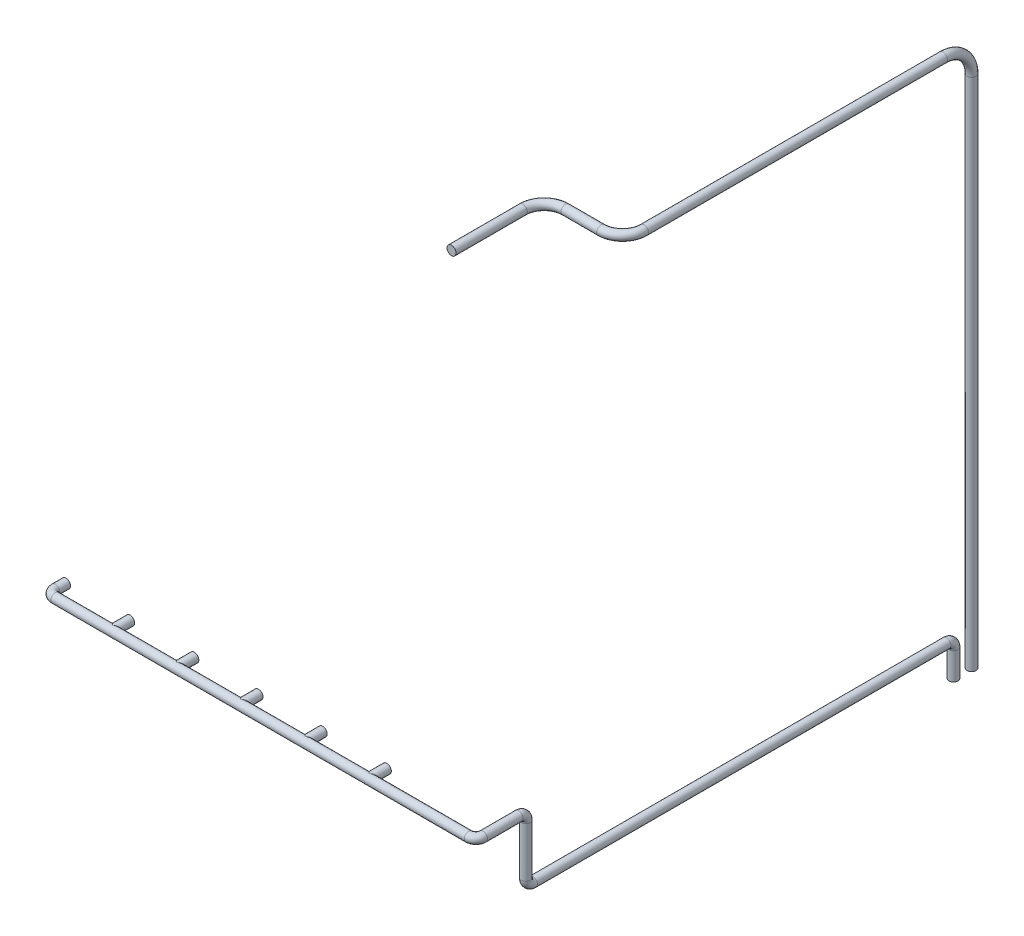
ISO-10303-21;
HEADER;
FILE_DESCRIPTION(('STEP AP214'),'2;1');
FILE_NAME('part.step','',(''),(''),'','','');
FILE_SCHEMA(('AUTOMOTIVE_DESIGN { 1 0 10303 214 1 1 1 1 }'));
ENDSEC;
DATA;
#1=APPLICATION_CONTEXT('core data for automotive mechanical design processes');
#2=APPLICATION_PROTOCOL_DEFINITION('international standard','automotive_design',2000,#1);
#3=PRODUCT_CONTEXT('',#1,'mechanical');
#4=PRODUCT('Part','Part','',(#3));
#5=PRODUCT_RELATED_PRODUCT_CATEGORY('part','',(#4));
#6=PRODUCT_DEFINITION_FORMATION('','',#4);
#7=PRODUCT_DEFINITION_CONTEXT('part definition',#1,'design');
#8=PRODUCT_DEFINITION('design','',#6,#7);
#9=PRODUCT_DEFINITION_SHAPE('','',#8);
#10=(LENGTH_UNIT() NAMED_UNIT(*) SI_UNIT(.MILLI.,.METRE.));
#11=(NAMED_UNIT(*) PLANE_ANGLE_UNIT() SI_UNIT($,.RADIAN.));
#12=(NAMED_UNIT(*) SI_UNIT($,.STERADIAN.) SOLID_ANGLE_UNIT());
#13=UNCERTAINTY_MEASURE_WITH_UNIT(LENGTH_MEASURE(1.E-05),#10,'distance_accuracy_value','');
#14=(GEOMETRIC_REPRESENTATION_CONTEXT(3) GLOBAL_UNCERTAINTY_ASSIGNED_CONTEXT((#13)) GLOBAL_UNIT_ASSIGNED_CONTEXT((#10,
#11,#12)) REPRESENTATION_CONTEXT('',''));
#15=CARTESIAN_POINT('',(0.,0.,0.));
#16=DIRECTION('',(0.,0.,1.));
#17=DIRECTION('',(1.,0.,0.));
#18=AXIS2_PLACEMENT_3D('',#15,#16,#17);
#19=CARTESIAN_POINT('',(6063.5,-1280.,-6704.));
#20=DIRECTION('',(0.,-1.,0.));
#21=DIRECTION('',(0.,0.,-1.));
#22=AXIS2_PLACEMENT_3D('',#19,#20,#21);
#23=CYLINDRICAL_SURFACE('',#22,63.5000000000008);
#24=CARTESIAN_POINT('',(6063.5,-1380.,-6704.));
#25=DIRECTION('',(0.,-1.,0.));
#26=DIRECTION('',(0.,0.,-1.));
#27=AXIS2_PLACEMENT_3D('',#24,#25,#26);
#28=CIRCLE('',#27,63.5000000000008);
#29=CARTESIAN_POINT('',(6063.5,-1380.,-6767.5));
#30=VERTEX_POINT('',#29);
#31=EDGE_CURVE('E12',#30,#30,#28,.T.);
#32=ORIENTED_EDGE('',*,*,#31,.F.);
#33=EDGE_LOOP('',(#32));
#34=FACE_BOUND('',#33,.T.);
#35=CARTESIAN_POINT('',(6063.5,5840.,-6704.));
#36=DIRECTION('',(0.,1.,0.));
#37=DIRECTION('',(0.,0.,1.));
#38=AXIS2_PLACEMENT_3D('',#35,#36,#37);
#39=CIRCLE('',#38,63.5000000000008);
#40=CARTESIAN_POINT('',(6063.5,5840.,-6767.5));
#41=VERTEX_POINT('',#40);
#42=EDGE_CURVE('E73',#41,#41,#39,.T.);
#43=ORIENTED_EDGE('',*,*,#42,.F.);
#44=EDGE_LOOP('',(#43));
#45=FACE_BOUND('',#44,.T.);
#46=ADVANCED_FACE('F45',(#34,#45),#23,.T.);
#47=CARTESIAN_POINT('',(6063.5,-1380.,-6704.));
#48=DIRECTION('',(0.,-1.,0.));
#49=DIRECTION('',(0.,0.,-1.));
#50=AXIS2_PLACEMENT_3D('',#47,#48,#49);
#51=PLANE('',#50);
#52=ORIENTED_EDGE('',*,*,#31,.T.);
#53=EDGE_LOOP('',(#52));
#54=FACE_BOUND('',#53,.T.);
#55=ADVANCED_FACE('F80',(#54),#51,.T.);
#56=CARTESIAN_POINT('',(4963.5,6240.,-507.720850112618));
#57=DIRECTION('',(0.,0.,1.));
#58=DIRECTION('',(0.,-1.,0.));
#59=AXIS2_PLACEMENT_3D('',#56,#57,#58);
#60=PLANE('',#59);
#61=CARTESIAN_POINT('',(4963.5,6240.,-507.720850112618));
#62=DIRECTION('',(0.,0.,1.));
#63=DIRECTION('',(0.,-1.,0.));
#64=AXIS2_PLACEMENT_3D('',#61,#62,#63);
#65=CIRCLE('',#64,63.5000000000008);
#66=CARTESIAN_POINT('',(4963.5,6176.5,-507.720850112618));
#67=VERTEX_POINT('',#66);
#68=EDGE_CURVE('E51',#67,#67,#65,.T.);
#69=ORIENTED_EDGE('',*,*,#68,.T.);
#70=EDGE_LOOP('',(#69));
#71=FACE_BOUND('',#70,.T.);
#72=ADVANCED_FACE('F55',(#71),#60,.T.);
#73=CARTESIAN_POINT('',(6063.5,5840.,-6304.));
#74=DIRECTION('',(1.,0.,0.));
#75=DIRECTION('',(0.,0.,-1.));
#76=AXIS2_PLACEMENT_3D('',#73,#74,#75);
#77=TOROIDAL_SURFACE('',#76,400.,63.5000000000008);
#78=CARTESIAN_POINT('',(6063.5,6240.,-6304.));
#79=DIRECTION('',(0.,0.,1.));
#80=DIRECTION('',(0.,-1.,0.));
#81=AXIS2_PLACEMENT_3D('',#78,#79,#80);
#82=CIRCLE('',#81,63.5000000000008);
#83=CARTESIAN_POINT('',(6063.5,6303.5,-6304.));
#84=VERTEX_POINT('',#83);
#85=EDGE_CURVE('E70',#84,#84,#82,.T.);
#86=CARTESIAN_POINT('',(6063.5,5840.,-6304.));
#87=DIRECTION('',(1.,0.,0.));
#88=DIRECTION('',(0.,0.,-1.));
#89=AXIS2_PLACEMENT_3D('',#86,#87,#88);
#90=CIRCLE('',#89,463.500000000001);
#91=EDGE_CURVE('',#41,#84,#90,.T.);
#92=ORIENTED_EDGE('',*,*,#42,.T.);
#93=ORIENTED_EDGE('',*,*,#85,.F.);
#94=ORIENTED_EDGE('',*,*,#91,.T.);
#95=ORIENTED_EDGE('',*,*,#91,.F.);
#96=EDGE_LOOP('',(#92,#94,#93,#95));
#97=FACE_BOUND('',#96,.T.);
#98=ADVANCED_FACE('F77',(#97),#77,.T.);
#99=CARTESIAN_POINT('',(6063.5,6240.,-6304.));
#100=DIRECTION('',(0.,0.,1.));
#101=DIRECTION('',(1.,0.,0.));
#102=AXIS2_PLACEMENT_3D('',#99,#100,#101);
#103=CYLINDRICAL_SURFACE('',#102,63.5000000000008);
#104=CARTESIAN_POINT('',(6063.5,6240.,-2107.72085011262));
#105=DIRECTION('',(0.,0.,1.));
#106=DIRECTION('',(0.,-1.,0.));
#107=AXIS2_PLACEMENT_3D('',#104,#105,#106);
#108=CIRCLE('',#107,63.5000000000008);
#109=CARTESIAN_POINT('',(6127.,6240.,-2107.72085011262));
#110=VERTEX_POINT('',#109);
#111=EDGE_CURVE('E67',#110,#110,#108,.T.);
#112=ORIENTED_EDGE('',*,*,#111,.F.);
#113=EDGE_LOOP('',(#112));
#114=FACE_BOUND('',#113,.T.);
#115=ORIENTED_EDGE('',*,*,#85,.T.);
#116=EDGE_LOOP('',(#115));
#117=FACE_BOUND('',#116,.T.);
#118=ADVANCED_FACE('F109',(#114,#117),#103,.T.);
#119=CARTESIAN_POINT('',(5763.5,6240.,-2107.72085011262));
#120=DIRECTION('',(0.,-1.,0.));
#121=DIRECTION('',(0.,0.,-1.));
#122=AXIS2_PLACEMENT_3D('',#119,#120,#121);
#123=TOROIDAL_SURFACE('',#122,300.,63.5000000000008);
#124=CARTESIAN_POINT('',(5763.5,6240.,-1807.72085011262));
#125=DIRECTION('',(-1.,0.,0.));
#126=DIRECTION('',(0.,-1.,0.));
#127=AXIS2_PLACEMENT_3D('',#124,#125,#126);
#128=CIRCLE('',#127,63.5000000000008);
#129=CARTESIAN_POINT('',(5763.5,6240.,-1744.22085011262));
#130=VERTEX_POINT('',#129);
#131=EDGE_CURVE('E64',#130,#130,#128,.T.);
#132=CARTESIAN_POINT('',(5763.5,6240.,-2107.72085011262));
#133=DIRECTION('',(0.,-1.,0.));
#134=DIRECTION('',(0.,0.,-1.));
#135=AXIS2_PLACEMENT_3D('',#132,#133,#134);
#136=CIRCLE('',#135,363.500000000001);
#137=EDGE_CURVE('',#110,#130,#136,.T.);
#138=ORIENTED_EDGE('',*,*,#111,.T.);
#139=ORIENTED_EDGE('',*,*,#131,.F.);
#140=ORIENTED_EDGE('',*,*,#137,.T.);
#141=ORIENTED_EDGE('',*,*,#137,.F.);
#142=EDGE_LOOP('',(#138,#140,#139,#141));
#143=FACE_BOUND('',#142,.T.);
#144=ADVANCED_FACE('F105',(#143),#123,.T.);
#145=CARTESIAN_POINT('',(5763.5,6240.,-1807.72085011262));
#146=DIRECTION('',(-1.,0.,0.));
#147=DIRECTION('',(0.,0.,1.));
#148=AXIS2_PLACEMENT_3D('',#145,#146,#147);
#149=CYLINDRICAL_SURFACE('',#148,63.5000000000008);
#150=CARTESIAN_POINT('',(5263.5,6240.,-1807.72085011262));
#151=DIRECTION('',(-1.,0.,0.));
#152=DIRECTION('',(0.,-1.,0.));
#153=AXIS2_PLACEMENT_3D('',#150,#151,#152);
#154=CIRCLE('',#153,63.5000000000008);
#155=CARTESIAN_POINT('',(5263.5,6240.,-1871.22085011262));
#156=VERTEX_POINT('',#155);
#157=EDGE_CURVE('E59',#156,#156,#154,.T.);
#158=ORIENTED_EDGE('',*,*,#157,.F.);
#159=EDGE_LOOP('',(#158));
#160=FACE_BOUND('',#159,.T.);
#161=ORIENTED_EDGE('',*,*,#131,.T.);
#162=EDGE_LOOP('',(#161));
#163=FACE_BOUND('',#162,.T.);
#164=ADVANCED_FACE('F98',(#160,#163),#149,.T.);
#165=CARTESIAN_POINT('',(5263.5,6240.,-1507.72085011262));
#166=DIRECTION('',(0.,1.,0.));
#167=DIRECTION('',(0.,0.,1.));
#168=AXIS2_PLACEMENT_3D('',#165,#166,#167);
#169=TOROIDAL_SURFACE('',#168,300.,63.5000000000008);
#170=CARTESIAN_POINT('',(4963.5,6240.,-1507.72085011262));
#171=DIRECTION('',(0.,0.,1.));
#172=DIRECTION('',(0.,-1.,0.));
#173=AXIS2_PLACEMENT_3D('',#170,#171,#172);
#174=CIRCLE('',#173,63.5000000000008);
#175=CARTESIAN_POINT('',(4900.,6240.,-1507.72085011262));
#176=VERTEX_POINT('',#175);
#177=EDGE_CURVE('E57',#176,#176,#174,.T.);
#178=CARTESIAN_POINT('',(5263.5,6240.,-1507.72085011262));
#179=DIRECTION('',(0.,1.,0.));
#180=DIRECTION('',(0.,0.,1.));
#181=AXIS2_PLACEMENT_3D('',#178,#179,#180);
#182=CIRCLE('',#181,363.500000000001);
#183=EDGE_CURVE('',#156,#176,#182,.T.);
#184=ORIENTED_EDGE('',*,*,#157,.T.);
#185=ORIENTED_EDGE('',*,*,#177,.F.);
#186=ORIENTED_EDGE('',*,*,#183,.T.);
#187=ORIENTED_EDGE('',*,*,#183,.F.);
#188=EDGE_LOOP('',(#184,#186,#185,#187));
#189=FACE_BOUND('',#188,.T.);
#190=ADVANCED_FACE('F93',(#189),#169,.T.);
#191=CARTESIAN_POINT('',(4963.5,6240.,-1507.72085011262));
#192=DIRECTION('',(0.,0.,1.));
#193=DIRECTION('',(1.,0.,0.));
#194=AXIS2_PLACEMENT_3D('',#191,#192,#193);
#195=CYLINDRICAL_SURFACE('',#194,63.5000000000008);
#196=ORIENTED_EDGE('',*,*,#68,.F.);
#197=EDGE_LOOP('',(#196));
#198=FACE_BOUND('',#197,.T.);
#199=ORIENTED_EDGE('',*,*,#177,.T.);
#200=EDGE_LOOP('',(#199));
#201=FACE_BOUND('',#200,.T.);
#202=ADVANCED_FACE('F86',(#198,#201),#195,.T.);
#203=CLOSED_SHELL('',(#46,#55,#72,#98,#118,#144,#164,#190,#202));
#204=MANIFOLD_SOLID_BREP('B2',#203);
#205=CARTESIAN_POINT('',(4563.5,0.,50.));
#206=DIRECTION('',(0.,0.,-1.));
#207=DIRECTION('',(-1.,0.,0.));
#208=AXIS2_PLACEMENT_3D('',#205,#206,#207);
#209=CYLINDRICAL_SURFACE('',#208,63.5000000000007);
#210=CARTESIAN_POINT('',(4563.5,0.,0.));
#211=DIRECTION('',(0.,0.,1.));
#212=DIRECTION('',(1.,0.,0.));
#213=AXIS2_PLACEMENT_3D('',#210,#211,#212);
#214=CIRCLE('',#213,63.5000000000007);
#215=CARTESIAN_POINT('',(4627.,0.,0.));
#216=VERTEX_POINT('',#215);
#217=EDGE_CURVE('E43',#216,#216,#214,.T.);
#218=ORIENTED_EDGE('',*,*,#217,.T.);
#219=EDGE_LOOP('',(#218));
#220=FACE_BOUND('',#219,.T.);
#221=CARTESIAN_POINT('',(4563.5,0.,250.));
#222=DIRECTION('',(-0.707106781186547,0.,-0.707106781186547));
#223=DIRECTION('',(0.707106781186547,0.,-0.707106781186547));
#224=AXIS2_PLACEMENT_3D('',#221,#222,#223);
#225=ELLIPSE('',#224,89.8025612106921,63.5000000000004);
#226=CARTESIAN_POINT('',(4563.5,63.5000000000004,250.));
#227=VERTEX_POINT('',#226);
#228=CARTESIAN_POINT('',(4563.5,-63.5000000000004,250.));
#229=VERTEX_POINT('',#228);
#230=EDGE_CURVE('E207',#227,#229,#225,.T.);
#231=ORIENTED_EDGE('',*,*,#230,.T.);
#232=CARTESIAN_POINT('',(4563.5,0.,250.));
#233=DIRECTION('',(0.707106781186547,0.,-0.707106781186547));
#234=DIRECTION('',(-0.707106781186547,0.,-0.707106781186547));
#235=AXIS2_PLACEMENT_3D('',#232,#233,#234);
#236=ELLIPSE('',#235,89.8025612106921,63.5000000000004);
#237=EDGE_CURVE('E199',#229,#227,#236,.T.);
#238=ORIENTED_EDGE('',*,*,#237,.T.);
#239=EDGE_LOOP('',(#231,#238));
#240=FACE_BOUND('',#239,.T.);
#241=ADVANCED_FACE('F192',(#220,#240),#209,.T.);
#242=CARTESIAN_POINT('',(4563.5,0.,0.));
#243=DIRECTION('',(0.,0.,1.));
#244=DIRECTION('',(1.,0.,0.));
#245=AXIS2_PLACEMENT_3D('',#242,#243,#244);
#246=PLANE('',#245);
#247=ORIENTED_EDGE('',*,*,#217,.F.);
#248=EDGE_LOOP('',(#247));
#249=FACE_BOUND('',#248,.T.);
#250=ADVANCED_FACE('F287',(#249),#246,.F.);
#251=CARTESIAN_POINT('',(163.5,0.,250.));
#252=DIRECTION('',(1.,0.,0.));
#253=DIRECTION('',(0.,0.,-1.));
#254=AXIS2_PLACEMENT_3D('',#251,#252,#253);
#255=CYLINDRICAL_SURFACE('',#254,63.5);
#256=CARTESIAN_POINT('',(3663.5,0.,250.));
#257=DIRECTION('',(0.707106781186547,0.,-0.707106781186547));
#258=DIRECTION('',(-0.707106781186547,0.,-0.707106781186547));
#259=AXIS2_PLACEMENT_3D('',#256,#257,#258);
#260=ELLIPSE('',#259,89.8025612106914,63.4999999999999);
#261=CARTESIAN_POINT('',(3663.5,-63.4999999999999,250.));
#262=VERTEX_POINT('',#261);
#263=CARTESIAN_POINT('',(3663.5,63.4999999999999,250.));
#264=VERTEX_POINT('',#263);
#265=EDGE_CURVE('E277',#262,#264,#260,.T.);
#266=ORIENTED_EDGE('',*,*,#265,.F.);
#267=CARTESIAN_POINT('',(3663.5,0.,250.));
#268=DIRECTION('',(-0.707106781186547,0.,-0.707106781186547));
#269=DIRECTION('',(0.707106781186547,0.,-0.707106781186547));
#270=AXIS2_PLACEMENT_3D('',#267,#268,#269);
#271=ELLIPSE('',#270,89.8025612106914,63.4999999999999);
#272=EDGE_CURVE('E276',#264,#262,#271,.T.);
#273=ORIENTED_EDGE('',*,*,#272,.F.);
#274=EDGE_LOOP('',(#266,#273));
#275=FACE_BOUND('',#274,.T.);
#276=CARTESIAN_POINT('',(1863.5,0.,250.));
#277=DIRECTION('',(0.707106781186547,0.,-0.707106781186547));
#278=DIRECTION('',(-0.707106781186547,0.,-0.707106781186547));
#279=AXIS2_PLACEMENT_3D('',#276,#277,#278);
#280=ELLIPSE('',#279,89.8025612106916,63.5);
#281=CARTESIAN_POINT('',(1863.5,-63.5,250.));
#282=VERTEX_POINT('',#281);
#283=CARTESIAN_POINT('',(1863.5,63.4999999999999,250.));
#284=VERTEX_POINT('',#283);
#285=EDGE_CURVE('E259',#282,#284,#280,.T.);
#286=ORIENTED_EDGE('',*,*,#285,.F.);
#287=CARTESIAN_POINT('',(1863.5,0.,250.));
#288=DIRECTION('',(-0.707106781186547,0.,-0.707106781186547));
#289=DIRECTION('',(0.707106781186547,0.,-0.707106781186547));
#290=AXIS2_PLACEMENT_3D('',#287,#288,#289);
#291=ELLIPSE('',#290,89.8025612106916,63.5);
#292=EDGE_CURVE('E258',#284,#282,#291,.T.);
#293=ORIENTED_EDGE('',*,*,#292,.F.);
#294=EDGE_LOOP('',(#286,#293));
#295=FACE_BOUND('',#294,.T.);
#296=CARTESIAN_POINT('',(163.5,0.,250.));
#297=DIRECTION('',(1.,0.,0.));
#298=DIRECTION('',(0.,0.,-1.));
#299=AXIS2_PLACEMENT_3D('',#296,#297,#298);
#300=CIRCLE('',#299,63.5);
#301=CARTESIAN_POINT('',(163.5,0.,313.5));
#302=VERTEX_POINT('',#301);
#303=EDGE_CURVE('E382',#302,#302,#300,.T.);
#304=ORIENTED_EDGE('',*,*,#303,.T.);
#305=EDGE_LOOP('',(#304));
#306=FACE_BOUND('',#305,.T.);
#307=CARTESIAN_POINT('',(5963.5,0.,250.));
#308=DIRECTION('',(1.,0.,0.));
#309=DIRECTION('',(0.,0.,-1.));
#310=AXIS2_PLACEMENT_3D('',#307,#308,#309);
#311=CIRCLE('',#310,63.5);
#312=CARTESIAN_POINT('',(5963.5,0.,313.5));
#313=VERTEX_POINT('',#312);
#314=EDGE_CURVE('E388',#313,#313,#311,.T.);
#315=ORIENTED_EDGE('',*,*,#314,.F.);
#316=EDGE_LOOP('',(#315));
#317=FACE_BOUND('',#316,.T.);
#318=CARTESIAN_POINT('',(963.5,0.,250.));
#319=DIRECTION('',(0.707106781186547,0.,-0.707106781186547));
#320=DIRECTION('',(-0.707106781186547,0.,-0.707106781186547));
#321=AXIS2_PLACEMENT_3D('',#318,#319,#320);
#322=ELLIPSE('',#321,89.8025612106916,63.5);
#323=CARTESIAN_POINT('',(963.5,-63.5,250.));
#324=VERTEX_POINT('',#323);
#325=CARTESIAN_POINT('',(963.5,63.5,250.));
#326=VERTEX_POINT('',#325);
#327=EDGE_CURVE('E250',#324,#326,#322,.T.);
#328=ORIENTED_EDGE('',*,*,#327,.F.);
#329=CARTESIAN_POINT('',(963.5,0.,250.));
#330=DIRECTION('',(-0.707106781186547,0.,-0.707106781186547));
#331=DIRECTION('',(0.707106781186547,0.,-0.707106781186547));
#332=AXIS2_PLACEMENT_3D('',#329,#330,#331);
#333=ELLIPSE('',#332,89.8025612106916,63.5);
#334=EDGE_CURVE('E243',#326,#324,#333,.T.);
#335=ORIENTED_EDGE('',*,*,#334,.F.);
#336=EDGE_LOOP('',(#328,#335));
#337=FACE_BOUND('',#336,.T.);
#338=CARTESIAN_POINT('',(2763.5,0.,250.));
#339=DIRECTION('',(0.707106781186547,0.,-0.707106781186547));
#340=DIRECTION('',(-0.707106781186547,0.,-0.707106781186547));
#341=AXIS2_PLACEMENT_3D('',#338,#339,#340);
#342=ELLIPSE('',#341,89.8025612106914,63.4999999999999);
#343=CARTESIAN_POINT('',(2763.5,-63.4999999999999,250.));
#344=VERTEX_POINT('',#343);
#345=CARTESIAN_POINT('',(2763.5,63.4999999999999,250.));
#346=VERTEX_POINT('',#345);
#347=EDGE_CURVE('E268',#344,#346,#342,.T.);
#348=ORIENTED_EDGE('',*,*,#347,.F.);
#349=CARTESIAN_POINT('',(2763.5,0.,250.));
#350=DIRECTION('',(-0.707106781186547,0.,-0.707106781186547));
#351=DIRECTION('',(0.707106781186547,0.,-0.707106781186547));
#352=AXIS2_PLACEMENT_3D('',#349,#350,#351);
#353=ELLIPSE('',#352,89.8025612106914,63.4999999999999);
#354=EDGE_CURVE('E267',#346,#344,#353,.T.);
#355=ORIENTED_EDGE('',*,*,#354,.F.);
#356=EDGE_LOOP('',(#348,#355));
#357=FACE_BOUND('',#356,.T.);
#358=ORIENTED_EDGE('',*,*,#237,.F.);
#359=ORIENTED_EDGE('',*,*,#230,.F.);
#360=EDGE_LOOP('',(#358,#359));
#361=FACE_BOUND('',#360,.T.);
#362=ADVANCED_FACE('F292',(#275,#295,#306,#317,#337,#357,#361),#255,.T.);
#363=CARTESIAN_POINT('',(3663.5,0.,50.));
#364=DIRECTION('',(0.,0.,-1.));
#365=DIRECTION('',(-1.,0.,0.));
#366=AXIS2_PLACEMENT_3D('',#363,#364,#365);
#367=CYLINDRICAL_SURFACE('',#366,63.4999999999999);
#368=CARTESIAN_POINT('',(3663.5,0.,0.));
#369=DIRECTION('',(0.,0.,1.));
#370=DIRECTION('',(1.,0.,0.));
#371=AXIS2_PLACEMENT_3D('',#368,#369,#370);
#372=CIRCLE('',#371,63.4999999999999);
#373=CARTESIAN_POINT('',(3727.,0.,0.));
#374=VERTEX_POINT('',#373);
#375=EDGE_CURVE('E280',#374,#374,#372,.T.);
#376=ORIENTED_EDGE('',*,*,#375,.T.);
#377=EDGE_LOOP('',(#376));
#378=FACE_BOUND('',#377,.T.);
#379=ORIENTED_EDGE('',*,*,#272,.T.);
#380=ORIENTED_EDGE('',*,*,#265,.T.);
#381=EDGE_LOOP('',(#379,#380));
#382=FACE_BOUND('',#381,.T.);
#383=ADVANCED_FACE('F298',(#378,#382),#367,.T.);
#384=CARTESIAN_POINT('',(3663.5,0.,0.));
#385=DIRECTION('',(0.,0.,1.));
#386=DIRECTION('',(1.,0.,0.));
#387=AXIS2_PLACEMENT_3D('',#384,#385,#386);
#388=PLANE('',#387);
#389=ORIENTED_EDGE('',*,*,#375,.F.);
#390=EDGE_LOOP('',(#389));
#391=FACE_BOUND('',#390,.T.);
#392=ADVANCED_FACE('F304',(#391),#388,.F.);
#393=CARTESIAN_POINT('',(2763.5,0.,50.));
#394=DIRECTION('',(0.,0.,-1.));
#395=DIRECTION('',(-1.,0.,0.));
#396=AXIS2_PLACEMENT_3D('',#393,#394,#395);
#397=CYLINDRICAL_SURFACE('',#396,63.4999999999999);
#398=CARTESIAN_POINT('',(2763.5,0.,0.));
#399=DIRECTION('',(0.,0.,1.));
#400=DIRECTION('',(1.,0.,0.));
#401=AXIS2_PLACEMENT_3D('',#398,#399,#400);
#402=CIRCLE('',#401,63.4999999999999);
#403=CARTESIAN_POINT('',(2827.,0.,0.));
#404=VERTEX_POINT('',#403);
#405=EDGE_CURVE('E271',#404,#404,#402,.T.);
#406=ORIENTED_EDGE('',*,*,#405,.T.);
#407=EDGE_LOOP('',(#406));
#408=FACE_BOUND('',#407,.T.);
#409=ORIENTED_EDGE('',*,*,#354,.T.);
#410=ORIENTED_EDGE('',*,*,#347,.T.);
#411=EDGE_LOOP('',(#409,#410));
#412=FACE_BOUND('',#411,.T.);
#413=ADVANCED_FACE('F308',(#408,#412),#397,.T.);
#414=CARTESIAN_POINT('',(2763.5,0.,0.));
#415=DIRECTION('',(0.,0.,1.));
#416=DIRECTION('',(1.,0.,0.));
#417=AXIS2_PLACEMENT_3D('',#414,#415,#416);
#418=PLANE('',#417);
#419=ORIENTED_EDGE('',*,*,#405,.F.);
#420=EDGE_LOOP('',(#419));
#421=FACE_BOUND('',#420,.T.);
#422=ADVANCED_FACE('F312',(#421),#418,.F.);
#423=CARTESIAN_POINT('',(1863.5,0.,50.));
#424=DIRECTION('',(0.,0.,-1.));
#425=DIRECTION('',(-1.,0.,0.));
#426=AXIS2_PLACEMENT_3D('',#423,#424,#425);
#427=CYLINDRICAL_SURFACE('',#426,63.4999999999999);
#428=CARTESIAN_POINT('',(1863.5,0.,0.));
#429=DIRECTION('',(0.,0.,1.));
#430=DIRECTION('',(1.,0.,0.));
#431=AXIS2_PLACEMENT_3D('',#428,#429,#430);
#432=CIRCLE('',#431,63.4999999999999);
#433=CARTESIAN_POINT('',(1927.,0.,0.));
#434=VERTEX_POINT('',#433);
#435=EDGE_CURVE('E262',#434,#434,#432,.T.);
#436=ORIENTED_EDGE('',*,*,#435,.T.);
#437=EDGE_LOOP('',(#436));
#438=FACE_BOUND('',#437,.T.);
#439=ORIENTED_EDGE('',*,*,#292,.T.);
#440=ORIENTED_EDGE('',*,*,#285,.T.);
#441=EDGE_LOOP('',(#439,#440));
#442=FACE_BOUND('',#441,.T.);
#443=ADVANCED_FACE('F316',(#438,#442),#427,.T.);
#444=CARTESIAN_POINT('',(1863.5,0.,0.));
#445=DIRECTION('',(0.,0.,1.));
#446=DIRECTION('',(1.,0.,0.));
#447=AXIS2_PLACEMENT_3D('',#444,#445,#446);
#448=PLANE('',#447);
#449=ORIENTED_EDGE('',*,*,#435,.F.);
#450=EDGE_LOOP('',(#449));
#451=FACE_BOUND('',#450,.T.);
#452=ADVANCED_FACE('F320',(#451),#448,.F.);
#453=CARTESIAN_POINT('',(963.5,0.,50.));
#454=DIRECTION('',(0.,0.,-1.));
#455=DIRECTION('',(-1.,0.,0.));
#456=AXIS2_PLACEMENT_3D('',#453,#454,#455);
#457=CYLINDRICAL_SURFACE('',#456,63.5000000000001);
#458=CARTESIAN_POINT('',(963.5,0.,0.));
#459=DIRECTION('',(0.,0.,1.));
#460=DIRECTION('',(1.,0.,0.));
#461=AXIS2_PLACEMENT_3D('',#458,#459,#460);
#462=CIRCLE('',#461,63.5000000000001);
#463=CARTESIAN_POINT('',(1027.,0.,0.));
#464=VERTEX_POINT('',#463);
#465=EDGE_CURVE('E253',#464,#464,#462,.T.);
#466=ORIENTED_EDGE('',*,*,#465,.T.);
#467=EDGE_LOOP('',(#466));
#468=FACE_BOUND('',#467,.T.);
#469=ORIENTED_EDGE('',*,*,#334,.T.);
#470=ORIENTED_EDGE('',*,*,#327,.T.);
#471=EDGE_LOOP('',(#469,#470));
#472=FACE_BOUND('',#471,.T.);
#473=ADVANCED_FACE('F324',(#468,#472),#457,.T.);
#474=CARTESIAN_POINT('',(963.5,0.,0.));
#475=DIRECTION('',(0.,0.,1.));
#476=DIRECTION('',(1.,0.,0.));
#477=AXIS2_PLACEMENT_3D('',#474,#475,#476);
#478=PLANE('',#477);
#479=ORIENTED_EDGE('',*,*,#465,.F.);
#480=EDGE_LOOP('',(#479));
#481=FACE_BOUND('',#480,.T.);
#482=ADVANCED_FACE('F328',(#481),#478,.F.);
#483=CARTESIAN_POINT('',(63.5,0.,50.));
#484=DIRECTION('',(0.,0.,-1.));
#485=DIRECTION('',(-1.,0.,0.));
#486=AXIS2_PLACEMENT_3D('',#483,#484,#485);
#487=CYLINDRICAL_SURFACE('',#486,63.5);
#488=CARTESIAN_POINT('',(63.5,0.,0.));
#489=DIRECTION('',(0.,0.,1.));
#490=DIRECTION('',(1.,0.,0.));
#491=AXIS2_PLACEMENT_3D('',#488,#489,#490);
#492=CIRCLE('',#491,63.5);
#493=CARTESIAN_POINT('',(127.,0.,0.));
#494=VERTEX_POINT('',#493);
#495=EDGE_CURVE('E239',#494,#494,#492,.T.);
#496=ORIENTED_EDGE('',*,*,#495,.T.);
#497=EDGE_LOOP('',(#496));
#498=FACE_BOUND('',#497,.T.);
#499=CARTESIAN_POINT('',(63.5,0.,150.));
#500=DIRECTION('',(0.,0.,1.));
#501=DIRECTION('',(1.,0.,0.));
#502=AXIS2_PLACEMENT_3D('',#499,#500,#501);
#503=CIRCLE('',#502,63.5);
#504=CARTESIAN_POINT('',(0.,0.,150.));
#505=VERTEX_POINT('',#504);
#506=EDGE_CURVE('E385',#505,#505,#503,.T.);
#507=ORIENTED_EDGE('',*,*,#506,.F.);
#508=EDGE_LOOP('',(#507));
#509=FACE_BOUND('',#508,.T.);
#510=ADVANCED_FACE('F332',(#498,#509),#487,.T.);
#511=CARTESIAN_POINT('',(63.5,0.,0.));
#512=DIRECTION('',(0.,0.,1.));
#513=DIRECTION('',(1.,0.,0.));
#514=AXIS2_PLACEMENT_3D('',#511,#512,#513);
#515=PLANE('',#514);
#516=ORIENTED_EDGE('',*,*,#495,.F.);
#517=EDGE_LOOP('',(#516));
#518=FACE_BOUND('',#517,.T.);
#519=ADVANCED_FACE('F336',(#518),#515,.F.);
#520=CARTESIAN_POINT('',(6063.5,-1380.,-6450.));
#521=DIRECTION('',(0.,-1.,0.));
#522=DIRECTION('',(-1.,0.,0.));
#523=AXIS2_PLACEMENT_3D('',#520,#521,#522);
#524=PLANE('',#523);
#525=CARTESIAN_POINT('',(6063.5,-1380.,-6450.));
#526=DIRECTION('',(0.,-1.,0.));
#527=DIRECTION('',(-1.,0.,0.));
#528=AXIS2_PLACEMENT_3D('',#525,#526,#527);
#529=CIRCLE('',#528,63.5);
#530=CARTESIAN_POINT('',(6000.,-1380.,-6450.));
#531=VERTEX_POINT('',#530);
#532=EDGE_CURVE('E236',#531,#531,#529,.T.);
#533=ORIENTED_EDGE('',*,*,#532,.T.);
#534=EDGE_LOOP('',(#533));
#535=FACE_BOUND('',#534,.T.);
#536=ADVANCED_FACE('F237',(#535),#524,.T.);
#537=CARTESIAN_POINT('',(163.5,0.,150.));
#538=DIRECTION('',(0.,1.,0.));
#539=DIRECTION('',(0.,0.,1.));
#540=AXIS2_PLACEMENT_3D('',#537,#538,#539);
#541=TOROIDAL_SURFACE('',#540,100.,63.5);
#542=CARTESIAN_POINT('',(163.5,0.,150.));
#543=DIRECTION('',(0.,1.,0.));
#544=DIRECTION('',(0.,0.,1.));
#545=AXIS2_PLACEMENT_3D('',#542,#543,#544);
#546=CIRCLE('',#545,163.5);
#547=EDGE_CURVE('',#505,#302,#546,.T.);
#548=ORIENTED_EDGE('',*,*,#506,.T.);
#549=ORIENTED_EDGE('',*,*,#303,.F.);
#550=ORIENTED_EDGE('',*,*,#547,.T.);
#551=ORIENTED_EDGE('',*,*,#547,.F.);
#552=EDGE_LOOP('',(#548,#550,#549,#551));
#553=FACE_BOUND('',#552,.T.);
#554=ADVANCED_FACE('F344',(#553),#541,.T.);
#555=CARTESIAN_POINT('',(5963.5,0.,150.));
#556=DIRECTION('',(0.,1.,0.));
#557=DIRECTION('',(0.,0.,1.));
#558=AXIS2_PLACEMENT_3D('',#555,#556,#557);
#559=TOROIDAL_SURFACE('',#558,99.9999999999998,63.5);
#560=CARTESIAN_POINT('',(6063.5,0.,150.));
#561=DIRECTION('',(0.,0.,-1.));
#562=DIRECTION('',(-1.,0.,0.));
#563=AXIS2_PLACEMENT_3D('',#560,#561,#562);
#564=CIRCLE('',#563,63.5);
#565=CARTESIAN_POINT('',(6127.,0.,150.));
#566=VERTEX_POINT('',#565);
#567=EDGE_CURVE('E393',#566,#566,#564,.T.);
#568=CARTESIAN_POINT('',(5963.5,0.,150.));
#569=DIRECTION('',(0.,1.,0.));
#570=DIRECTION('',(0.,0.,1.));
#571=AXIS2_PLACEMENT_3D('',#568,#569,#570);
#572=CIRCLE('',#571,163.5);
#573=EDGE_CURVE('',#313,#566,#572,.T.);
#574=ORIENTED_EDGE('',*,*,#314,.T.);
#575=ORIENTED_EDGE('',*,*,#567,.F.);
#576=ORIENTED_EDGE('',*,*,#573,.T.);
#577=ORIENTED_EDGE('',*,*,#573,.F.);
#578=EDGE_LOOP('',(#574,#576,#575,#577));
#579=FACE_BOUND('',#578,.T.);
#580=ADVANCED_FACE('F370',(#579),#559,.T.);
#581=CARTESIAN_POINT('',(6063.5,0.,150.));
#582=DIRECTION('',(0.,0.,-1.));
#583=DIRECTION('',(-1.,0.,0.));
#584=AXIS2_PLACEMENT_3D('',#581,#582,#583);
#585=CYLINDRICAL_SURFACE('',#584,63.5);
#586=CARTESIAN_POINT('',(6063.5,0.,-350.));
#587=DIRECTION('',(0.,0.,-1.));
#588=DIRECTION('',(-1.,0.,0.));
#589=AXIS2_PLACEMENT_3D('',#586,#587,#588);
#590=CIRCLE('',#589,63.5);
#591=CARTESIAN_POINT('',(6063.5,63.5,-350.));
#592=VERTEX_POINT('',#591);
#593=EDGE_CURVE('E396',#592,#592,#590,.T.);
#594=ORIENTED_EDGE('',*,*,#593,.F.);
#595=EDGE_LOOP('',(#594));
#596=FACE_BOUND('',#595,.T.);
#597=ORIENTED_EDGE('',*,*,#567,.T.);
#598=EDGE_LOOP('',(#597));
#599=FACE_BOUND('',#598,.T.);
#600=ADVANCED_FACE('F366',(#596,#599),#585,.T.);
#601=CARTESIAN_POINT('',(6063.5,-100.,-350.));
#602=DIRECTION('',(-1.,0.,0.));
#603=DIRECTION('',(0.,0.,1.));
#604=AXIS2_PLACEMENT_3D('',#601,#602,#603);
#605=TOROIDAL_SURFACE('',#604,100.,63.5);
#606=CARTESIAN_POINT('',(6063.5,-100.,-450.));
#607=DIRECTION('',(0.,-1.,0.));
#608=DIRECTION('',(-1.,0.,0.));
#609=AXIS2_PLACEMENT_3D('',#606,#607,#608);
#610=CIRCLE('',#609,63.5);
#611=CARTESIAN_POINT('',(6063.5,-100.,-513.5));
#612=VERTEX_POINT('',#611);
#613=EDGE_CURVE('E399',#612,#612,#610,.T.);
#614=CARTESIAN_POINT('',(6063.5,-100.,-350.));
#615=DIRECTION('',(-1.,0.,0.));
#616=DIRECTION('',(0.,0.,1.));
#617=AXIS2_PLACEMENT_3D('',#614,#615,#616);
#618=CIRCLE('',#617,163.5);
#619=EDGE_CURVE('',#592,#612,#618,.T.);
#620=ORIENTED_EDGE('',*,*,#593,.T.);
#621=ORIENTED_EDGE('',*,*,#613,.F.);
#622=ORIENTED_EDGE('',*,*,#619,.T.);
#623=ORIENTED_EDGE('',*,*,#619,.F.);
#624=EDGE_LOOP('',(#620,#622,#621,#623));
#625=FACE_BOUND('',#624,.T.);
#626=ADVANCED_FACE('F362',(#625),#605,.T.);
#627=CARTESIAN_POINT('',(6063.5,-100.,-450.));
#628=DIRECTION('',(0.,-1.,0.));
#629=DIRECTION('',(0.,0.,-1.));
#630=AXIS2_PLACEMENT_3D('',#627,#628,#629);
#631=CYLINDRICAL_SURFACE('',#630,63.5);
#632=CARTESIAN_POINT('',(6063.5,-800.,-450.));
#633=DIRECTION('',(0.,-1.,0.));
#634=DIRECTION('',(-1.,0.,0.));
#635=AXIS2_PLACEMENT_3D('',#632,#633,#634);
#636=CIRCLE('',#635,63.5);
#637=CARTESIAN_POINT('',(6063.5,-800.,-386.5));
#638=VERTEX_POINT('',#637);
#639=EDGE_CURVE('E402',#638,#638,#636,.T.);
#640=ORIENTED_EDGE('',*,*,#639,.F.);
#641=EDGE_LOOP('',(#640));
#642=FACE_BOUND('',#641,.T.);
#643=ORIENTED_EDGE('',*,*,#613,.T.);
#644=EDGE_LOOP('',(#643));
#645=FACE_BOUND('',#644,.T.);
#646=ADVANCED_FACE('F358',(#642,#645),#631,.T.);
#647=CARTESIAN_POINT('',(6063.5,-800.,-550.));
#648=DIRECTION('',(1.,0.,0.));
#649=DIRECTION('',(0.,0.,-1.));
#650=AXIS2_PLACEMENT_3D('',#647,#648,#649);
#651=TOROIDAL_SURFACE('',#650,100.,63.5);
#652=CARTESIAN_POINT('',(6063.5,-900.,-550.));
#653=DIRECTION('',(0.,0.,-1.));
#654=DIRECTION('',(-1.,0.,0.));
#655=AXIS2_PLACEMENT_3D('',#652,#653,#654);
#656=CIRCLE('',#655,63.5);
#657=CARTESIAN_POINT('',(6063.5,-963.5,-550.));
#658=VERTEX_POINT('',#657);
#659=EDGE_CURVE('E405',#658,#658,#656,.T.);
#660=CARTESIAN_POINT('',(6063.5,-800.,-550.));
#661=DIRECTION('',(1.,0.,0.));
#662=DIRECTION('',(0.,0.,-1.));
#663=AXIS2_PLACEMENT_3D('',#660,#661,#662);
#664=CIRCLE('',#663,163.5);
#665=EDGE_CURVE('',#638,#658,#664,.T.);
#666=ORIENTED_EDGE('',*,*,#639,.T.);
#667=ORIENTED_EDGE('',*,*,#659,.F.);
#668=ORIENTED_EDGE('',*,*,#665,.T.);
#669=ORIENTED_EDGE('',*,*,#665,.F.);
#670=EDGE_LOOP('',(#666,#668,#667,#669));
#671=FACE_BOUND('',#670,.T.);
#672=ADVANCED_FACE('F354',(#671),#651,.T.);
#673=CARTESIAN_POINT('',(6063.5,-900.,-550.));
#674=DIRECTION('',(0.,0.,-1.));
#675=DIRECTION('',(-1.,0.,0.));
#676=AXIS2_PLACEMENT_3D('',#673,#674,#675);
#677=CYLINDRICAL_SURFACE('',#676,63.5);
#678=CARTESIAN_POINT('',(6063.5,-900.,-6350.));
#679=DIRECTION('',(0.,0.,-1.));
#680=DIRECTION('',(-1.,0.,0.));
#681=AXIS2_PLACEMENT_3D('',#678,#679,#680);
#682=CIRCLE('',#681,63.5);
#683=CARTESIAN_POINT('',(6063.5,-836.5,-6350.));
#684=VERTEX_POINT('',#683);
#685=EDGE_CURVE('E246',#684,#684,#682,.T.);
#686=ORIENTED_EDGE('',*,*,#685,.F.);
#687=EDGE_LOOP('',(#686));
#688=FACE_BOUND('',#687,.T.);
#689=ORIENTED_EDGE('',*,*,#659,.T.);
#690=EDGE_LOOP('',(#689));
#691=FACE_BOUND('',#690,.T.);
#692=ADVANCED_FACE('F350',(#688,#691),#677,.T.);
#693=CARTESIAN_POINT('',(6063.5,-1000.,-6350.));
#694=DIRECTION('',(-1.,0.,0.));
#695=DIRECTION('',(0.,0.,1.));
#696=AXIS2_PLACEMENT_3D('',#693,#694,#695);
#697=TOROIDAL_SURFACE('',#696,99.9999999999999,63.5);
#698=CARTESIAN_POINT('',(6063.5,-1000.,-6450.));
#699=DIRECTION('',(0.,-1.,0.));
#700=DIRECTION('',(-1.,0.,0.));
#701=AXIS2_PLACEMENT_3D('',#698,#699,#700);
#702=CIRCLE('',#701,63.5);
#703=CARTESIAN_POINT('',(6063.5,-1000.,-6513.5));
#704=VERTEX_POINT('',#703);
#705=EDGE_CURVE('E240',#704,#704,#702,.T.);
#706=CARTESIAN_POINT('',(6063.5,-1000.,-6350.));
#707=DIRECTION('',(-1.,0.,0.));
#708=DIRECTION('',(0.,0.,1.));
#709=AXIS2_PLACEMENT_3D('',#706,#707,#708);
#710=CIRCLE('',#709,163.5);
#711=EDGE_CURVE('',#684,#704,#710,.T.);
#712=ORIENTED_EDGE('',*,*,#685,.T.);
#713=ORIENTED_EDGE('',*,*,#705,.F.);
#714=ORIENTED_EDGE('',*,*,#711,.T.);
#715=ORIENTED_EDGE('',*,*,#711,.F.);
#716=EDGE_LOOP('',(#712,#714,#713,#715));
#717=FACE_BOUND('',#716,.T.);
#718=ADVANCED_FACE('F347',(#717),#697,.T.);
#719=CARTESIAN_POINT('',(6063.5,-1000.,-6450.));
#720=DIRECTION('',(0.,-1.,0.));
#721=DIRECTION('',(0.,0.,-1.));
#722=AXIS2_PLACEMENT_3D('',#719,#720,#721);
#723=CYLINDRICAL_SURFACE('',#722,63.5);
#724=ORIENTED_EDGE('',*,*,#532,.F.);
#725=EDGE_LOOP('',(#724));
#726=FACE_BOUND('',#725,.T.);
#727=ORIENTED_EDGE('',*,*,#705,.T.);
#728=EDGE_LOOP('',(#727));
#729=FACE_BOUND('',#728,.T.);
#730=ADVANCED_FACE('F341',(#726,#729),#723,.T.);
#731=CLOSED_SHELL('',(#241,#250,#362,#383,#392,#413,#422,#443,#452,#473,#482,#510,#519,#536,
#554,#580,#600,#626,#646,#672,#692,#718,#730));
#732=MANIFOLD_SOLID_BREP('B6',#731);
#733=ADVANCED_BREP_SHAPE_REPRESENTATION('',(#18,#204,#732),#14);
#734=SHAPE_DEFINITION_REPRESENTATION(#9,#733);
ENDSEC;
END-ISO-10303-21;
